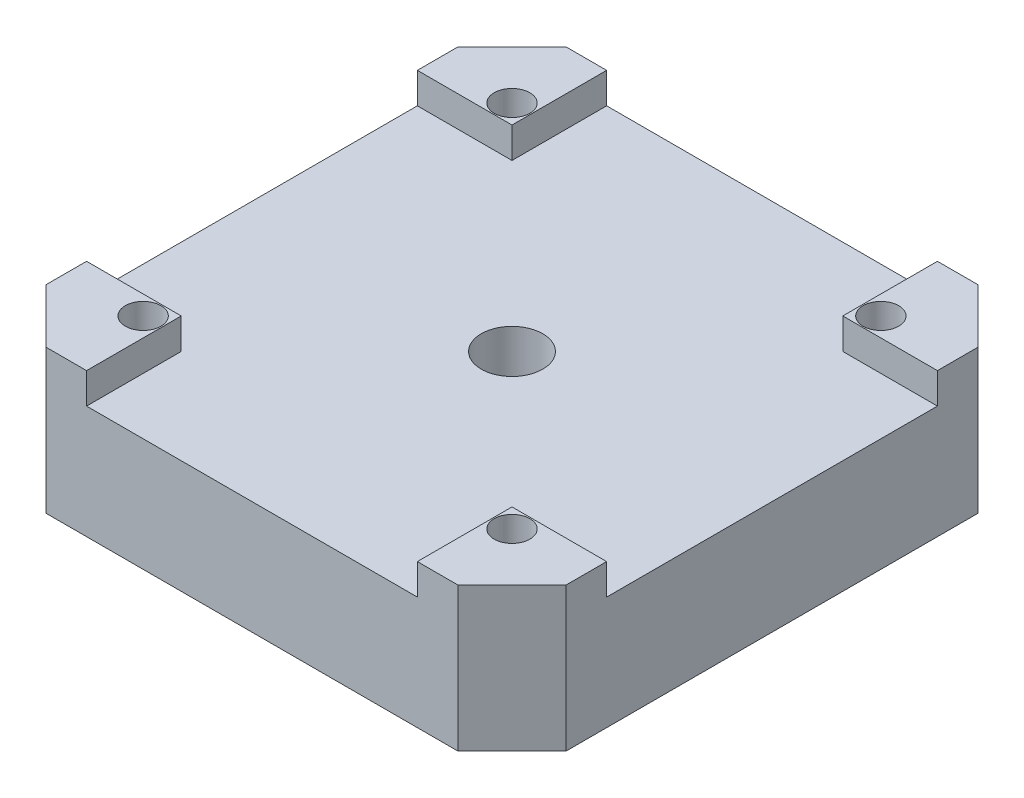
ISO-10303-21;
HEADER;
FILE_DESCRIPTION(('STEP AP214'),'2;1');
FILE_NAME('part.step','',(''),(''),'','','');
FILE_SCHEMA(('AUTOMOTIVE_DESIGN { 1 0 10303 214 1 1 1 1 }'));
ENDSEC;
DATA;
#1=APPLICATION_CONTEXT('core data for automotive mechanical design processes');
#2=APPLICATION_PROTOCOL_DEFINITION('international standard','automotive_design',2000,#1);
#3=PRODUCT_CONTEXT('',#1,'mechanical');
#4=PRODUCT('Part','Part','',(#3));
#5=PRODUCT_RELATED_PRODUCT_CATEGORY('part','',(#4));
#6=PRODUCT_DEFINITION_FORMATION('','',#4);
#7=PRODUCT_DEFINITION_CONTEXT('part definition',#1,'design');
#8=PRODUCT_DEFINITION('design','',#6,#7);
#9=PRODUCT_DEFINITION_SHAPE('','',#8);
#10=(LENGTH_UNIT() NAMED_UNIT(*) SI_UNIT(.MILLI.,.METRE.));
#11=(NAMED_UNIT(*) PLANE_ANGLE_UNIT() SI_UNIT($,.RADIAN.));
#12=(NAMED_UNIT(*) SI_UNIT($,.STERADIAN.) SOLID_ANGLE_UNIT());
#13=UNCERTAINTY_MEASURE_WITH_UNIT(LENGTH_MEASURE(1.E-05),#10,'distance_accuracy_value','');
#14=(GEOMETRIC_REPRESENTATION_CONTEXT(3) GLOBAL_UNCERTAINTY_ASSIGNED_CONTEXT((#13)) GLOBAL_UNIT_ASSIGNED_CONTEXT((#10,
#11,#12)) REPRESENTATION_CONTEXT('',''));
#15=CARTESIAN_POINT('',(0.,0.,0.));
#16=DIRECTION('',(0.,0.,1.));
#17=DIRECTION('',(1.,0.,0.));
#18=AXIS2_PLACEMENT_3D('',#15,#16,#17);
#19=CARTESIAN_POINT('',(0.,11.7,0.));
#20=DIRECTION('',(0.,-1.,0.));
#21=DIRECTION('',(0.,0.,-1.));
#22=AXIS2_PLACEMENT_3D('',#19,#20,#21);
#23=PLANE('',#22);
#24=CARTESIAN_POINT('',(15.,11.7,-15.));
#25=DIRECTION('',(0.,-1.,0.));
#26=DIRECTION('',(0.,0.,-1.));
#27=AXIS2_PLACEMENT_3D('',#24,#25,#26);
#28=CIRCLE('',#27,1.45);
#29=CARTESIAN_POINT('',(15.,11.7,-16.45));
#30=VERTEX_POINT('',#29);
#31=EDGE_CURVE('E362',#30,#30,#28,.T.);
#32=ORIENTED_EDGE('',*,*,#31,.T.);
#33=EDGE_LOOP('',(#32));
#34=FACE_BOUND('',#33,.T.);
#35=DIRECTION('',(-1.,0.,0.));
#36=VECTOR('',#35,1.);
#37=CARTESIAN_POINT('',(-16.750923471599,11.7,-21.15));
#38=LINE('',#37,#36);
#39=CARTESIAN_POINT('',(16.750923471599,11.7,-21.15));
#40=VERTEX_POINT('',#39);
#41=CARTESIAN_POINT('',(13.450923471599,11.7,-21.15));
#42=VERTEX_POINT('',#41);
#43=EDGE_CURVE('E191',#40,#42,#38,.T.);
#44=ORIENTED_EDGE('',*,*,#43,.T.);
#45=DIRECTION('',(0.,0.,1.));
#46=VECTOR('',#45,1.);
#47=CARTESIAN_POINT('',(13.450923471599,11.7,-21.15));
#48=LINE('',#47,#46);
#49=CARTESIAN_POINT('',(13.450923471599,11.7,-13.4509234715989));
#50=VERTEX_POINT('',#49);
#51=EDGE_CURVE('E299',#42,#50,#48,.T.);
#52=ORIENTED_EDGE('',*,*,#51,.T.);
#53=DIRECTION('',(1.,0.,0.));
#54=VECTOR('',#53,1.);
#55=CARTESIAN_POINT('',(-21.15,11.7,-13.4509234715989));
#56=LINE('',#55,#54);
#57=CARTESIAN_POINT('',(21.15,11.7,-13.4509234715989));
#58=VERTEX_POINT('',#57);
#59=EDGE_CURVE('E285',#50,#58,#56,.T.);
#60=ORIENTED_EDGE('',*,*,#59,.T.);
#61=DIRECTION('',(0.,0.,-1.));
#62=VECTOR('',#61,1.);
#63=CARTESIAN_POINT('',(21.15,11.7,16.7509234715989));
#64=LINE('',#63,#62);
#65=CARTESIAN_POINT('',(21.15,11.7,-16.7509234715989));
#66=VERTEX_POINT('',#65);
#67=EDGE_CURVE('E273',#58,#66,#64,.T.);
#68=ORIENTED_EDGE('',*,*,#67,.T.);
#69=DIRECTION('',(-0.707106781186542,0.,-0.707106781186553));
#70=VECTOR('',#69,1.);
#71=CARTESIAN_POINT('',(16.750923471599,11.7,-21.15));
#72=LINE('',#71,#70);
#73=EDGE_CURVE('E192',#66,#40,#72,.T.);
#74=ORIENTED_EDGE('',*,*,#73,.T.);
#75=EDGE_LOOP('',(#44,#52,#60,#68,#74));
#76=FACE_BOUND('',#75,.T.);
#77=ADVANCED_FACE('F32',(#34,#76),#23,.F.);
#78=CARTESIAN_POINT('',(15.,11.7,15.));
#79=DIRECTION('',(0.,-1.,0.));
#80=DIRECTION('',(0.,0.,-1.));
#81=AXIS2_PLACEMENT_3D('',#78,#79,#80);
#82=CIRCLE('',#81,1.45);
#83=CARTESIAN_POINT('',(15.,11.7,13.55));
#84=VERTEX_POINT('',#83);
#85=EDGE_CURVE('E374',#84,#84,#82,.T.);
#86=ORIENTED_EDGE('',*,*,#85,.T.);
#87=EDGE_LOOP('',(#86));
#88=FACE_BOUND('',#87,.T.);
#89=DIRECTION('',(1.,0.,0.));
#90=VECTOR('',#89,1.);
#91=CARTESIAN_POINT('',(-21.15,11.7,13.4509234715989));
#92=LINE('',#91,#90);
#93=CARTESIAN_POINT('',(13.450923471599,11.7,13.4509234715989));
#94=VERTEX_POINT('',#93);
#95=CARTESIAN_POINT('',(21.15,11.7,13.4509234715989));
#96=VERTEX_POINT('',#95);
#97=EDGE_CURVE('E263',#94,#96,#92,.T.);
#98=ORIENTED_EDGE('',*,*,#97,.F.);
#99=CARTESIAN_POINT('',(13.450923471599,11.7,21.15));
#100=VERTEX_POINT('',#99);
#101=EDGE_CURVE('E302',#94,#100,#48,.T.);
#102=ORIENTED_EDGE('',*,*,#101,.T.);
#103=DIRECTION('',(1.,0.,0.));
#104=VECTOR('',#103,1.);
#105=CARTESIAN_POINT('',(-16.750923471599,11.7,21.15));
#106=LINE('',#105,#104);
#107=CARTESIAN_POINT('',(16.750923471599,11.7,21.15));
#108=VERTEX_POINT('',#107);
#109=EDGE_CURVE('E268',#100,#108,#106,.T.);
#110=ORIENTED_EDGE('',*,*,#109,.T.);
#111=DIRECTION('',(0.707106781186546,0.,-0.707106781186549));
#112=VECTOR('',#111,1.);
#113=CARTESIAN_POINT('',(16.750923471599,11.7,21.15));
#114=LINE('',#113,#112);
#115=CARTESIAN_POINT('',(21.15,11.7,16.7509234715989));
#116=VERTEX_POINT('',#115);
#117=EDGE_CURVE('E272',#108,#116,#114,.T.);
#118=ORIENTED_EDGE('',*,*,#117,.T.);
#119=EDGE_CURVE('E196',#116,#96,#64,.T.);
#120=ORIENTED_EDGE('',*,*,#119,.T.);
#121=EDGE_LOOP('',(#98,#102,#110,#118,#120));
#122=FACE_BOUND('',#121,.T.);
#123=ADVANCED_FACE('F435',(#88,#122),#23,.F.);
#124=CARTESIAN_POINT('',(-21.15,9.2,-13.4509234715989));
#125=DIRECTION('',(0.,0.,-1.));
#126=DIRECTION('',(-1.,0.,0.));
#127=AXIS2_PLACEMENT_3D('',#124,#125,#126);
#128=PLANE('',#127);
#129=ORIENTED_EDGE('',*,*,#59,.F.);
#130=DIRECTION('',(0.,-1.,0.));
#131=VECTOR('',#130,1.);
#132=CARTESIAN_POINT('',(13.450923471599,9.20000000000002,-13.4509234715989));
#133=LINE('',#132,#131);
#134=CARTESIAN_POINT('',(13.450923471599,9.2,-13.4509234715989));
#135=VERTEX_POINT('',#134);
#136=EDGE_CURVE('E307',#50,#135,#133,.T.);
#137=ORIENTED_EDGE('',*,*,#136,.T.);
#138=DIRECTION('',(1.,0.,0.));
#139=VECTOR('',#138,1.);
#140=CARTESIAN_POINT('',(-21.15,9.2,-13.4509234715989));
#141=LINE('',#140,#139);
#142=CARTESIAN_POINT('',(21.15,9.2,-13.4509234715989));
#143=VERTEX_POINT('',#142);
#144=EDGE_CURVE('E255',#135,#143,#141,.T.);
#145=ORIENTED_EDGE('',*,*,#144,.T.);
#146=DIRECTION('',(0.,1.,0.));
#147=VECTOR('',#146,1.);
#148=CARTESIAN_POINT('',(21.15,9.2,-13.4509234715989));
#149=LINE('',#148,#147);
#150=EDGE_CURVE('E309',#143,#58,#149,.T.);
#151=ORIENTED_EDGE('',*,*,#150,.T.);
#152=EDGE_LOOP('',(#129,#137,#145,#151));
#153=FACE_BOUND('',#152,.T.);
#154=ADVANCED_FACE('F306',(#153),#128,.F.);
#155=CARTESIAN_POINT('',(-21.15,11.7,13.4509234715989));
#156=DIRECTION('',(0.,0.,1.));
#157=DIRECTION('',(1.,0.,0.));
#158=AXIS2_PLACEMENT_3D('',#155,#156,#157);
#159=PLANE('',#158);
#160=DIRECTION('',(1.,0.,0.));
#161=VECTOR('',#160,1.);
#162=CARTESIAN_POINT('',(-21.15,9.2,13.4509234715989));
#163=LINE('',#162,#161);
#164=CARTESIAN_POINT('',(13.450923471599,9.2,13.4509234715989));
#165=VERTEX_POINT('',#164);
#166=CARTESIAN_POINT('',(21.15,9.2,13.4509234715989));
#167=VERTEX_POINT('',#166);
#168=EDGE_CURVE('E256',#165,#167,#163,.T.);
#169=ORIENTED_EDGE('',*,*,#168,.F.);
#170=DIRECTION('',(0.,1.,0.));
#171=VECTOR('',#170,1.);
#172=CARTESIAN_POINT('',(13.450923471599,11.7,13.4509234715989));
#173=LINE('',#172,#171);
#174=EDGE_CURVE('E11',#165,#94,#173,.T.);
#175=ORIENTED_EDGE('',*,*,#174,.T.);
#176=ORIENTED_EDGE('',*,*,#97,.T.);
#177=DIRECTION('',(0.,-1.,0.));
#178=VECTOR('',#177,1.);
#179=CARTESIAN_POINT('',(21.15,11.7,13.4509234715989));
#180=LINE('',#179,#178);
#181=EDGE_CURVE('E317',#96,#167,#180,.T.);
#182=ORIENTED_EDGE('',*,*,#181,.T.);
#183=EDGE_LOOP('',(#169,#175,#176,#182));
#184=FACE_BOUND('',#183,.T.);
#185=ADVANCED_FACE('F445',(#184),#159,.F.);
#186=CARTESIAN_POINT('',(-15.,11.7,-15.));
#187=DIRECTION('',(0.,-1.,0.));
#188=DIRECTION('',(0.,0.,-1.));
#189=AXIS2_PLACEMENT_3D('',#186,#187,#188);
#190=CIRCLE('',#189,1.45);
#191=CARTESIAN_POINT('',(-15.,11.7,-16.45));
#192=VERTEX_POINT('',#191);
#193=EDGE_CURVE('E350',#192,#192,#190,.T.);
#194=ORIENTED_EDGE('',*,*,#193,.T.);
#195=EDGE_LOOP('',(#194));
#196=FACE_BOUND('',#195,.T.);
#197=CARTESIAN_POINT('',(-21.15,11.7,-13.4509234715989));
#198=VERTEX_POINT('',#197);
#199=CARTESIAN_POINT('',(-13.450923471599,11.7,-13.4509234715989));
#200=VERTEX_POINT('',#199);
#201=EDGE_CURVE('E184',#198,#200,#56,.T.);
#202=ORIENTED_EDGE('',*,*,#201,.T.);
#203=DIRECTION('',(0.,0.,1.));
#204=VECTOR('',#203,1.);
#205=CARTESIAN_POINT('',(-13.450923471599,11.7,-21.15));
#206=LINE('',#205,#204);
#207=CARTESIAN_POINT('',(-13.450923471599,11.7,-21.15));
#208=VERTEX_POINT('',#207);
#209=EDGE_CURVE('E47',#208,#200,#206,.T.);
#210=ORIENTED_EDGE('',*,*,#209,.F.);
#211=CARTESIAN_POINT('',(-16.750923471599,11.7,-21.15));
#212=VERTEX_POINT('',#211);
#213=EDGE_CURVE('E181',#208,#212,#38,.T.);
#214=ORIENTED_EDGE('',*,*,#213,.T.);
#215=DIRECTION('',(-0.707106781186546,0.,0.707106781186549));
#216=VECTOR('',#215,1.);
#217=CARTESIAN_POINT('',(-21.15,11.7,-16.7509234715989));
#218=LINE('',#217,#216);
#219=CARTESIAN_POINT('',(-21.15,11.7,-16.7509234715989));
#220=VERTEX_POINT('',#219);
#221=EDGE_CURVE('E195',#212,#220,#218,.T.);
#222=ORIENTED_EDGE('',*,*,#221,.T.);
#223=DIRECTION('',(0.,0.,1.));
#224=VECTOR('',#223,1.);
#225=CARTESIAN_POINT('',(-21.15,11.7,16.7509234715989));
#226=LINE('',#225,#224);
#227=EDGE_CURVE('E264',#220,#198,#226,.T.);
#228=ORIENTED_EDGE('',*,*,#227,.T.);
#229=EDGE_LOOP('',(#202,#210,#214,#222,#228));
#230=FACE_BOUND('',#229,.T.);
#231=ADVANCED_FACE('F180',(#196,#230),#23,.F.);
#232=CARTESIAN_POINT('',(-21.15,11.7,16.7509234715989));
#233=DIRECTION('',(1.,0.,0.));
#234=DIRECTION('',(0.,0.,-1.));
#235=AXIS2_PLACEMENT_3D('',#232,#233,#234);
#236=PLANE('',#235);
#237=DIRECTION('',(0.,0.,-1.));
#238=VECTOR('',#237,1.);
#239=CARTESIAN_POINT('',(-21.15,9.2,13.4509234715989));
#240=LINE('',#239,#238);
#241=CARTESIAN_POINT('',(-21.15,9.2,13.4509234715989));
#242=VERTEX_POINT('',#241);
#243=CARTESIAN_POINT('',(-21.15,9.2,-13.4509234715989));
#244=VERTEX_POINT('',#243);
#245=EDGE_CURVE('E253',#242,#244,#240,.T.);
#246=ORIENTED_EDGE('',*,*,#245,.T.);
#247=DIRECTION('',(0.,1.,0.));
#248=VECTOR('',#247,1.);
#249=CARTESIAN_POINT('',(-21.15,9.2,-13.4509234715989));
#250=LINE('',#249,#248);
#251=EDGE_CURVE('E320',#244,#198,#250,.T.);
#252=ORIENTED_EDGE('',*,*,#251,.T.);
#253=ORIENTED_EDGE('',*,*,#227,.F.);
#254=DIRECTION('',(0.,-1.,0.));
#255=VECTOR('',#254,1.);
#256=CARTESIAN_POINT('',(-21.15,11.7,-16.7509234715989));
#257=LINE('',#256,#255);
#258=CARTESIAN_POINT('',(-21.15,0.,-16.7509234715989));
#259=VERTEX_POINT('',#258);
#260=EDGE_CURVE('E201',#220,#259,#257,.T.);
#261=ORIENTED_EDGE('',*,*,#260,.T.);
#262=DIRECTION('',(0.,0.,1.));
#263=VECTOR('',#262,1.);
#264=CARTESIAN_POINT('',(-21.15,0.,16.7509234715989));
#265=LINE('',#264,#263);
#266=CARTESIAN_POINT('',(-21.15,0.,16.7509234715989));
#267=VERTEX_POINT('',#266);
#268=EDGE_CURVE('E202',#259,#267,#265,.T.);
#269=ORIENTED_EDGE('',*,*,#268,.T.);
#270=DIRECTION('',(0.,-1.,0.));
#271=VECTOR('',#270,1.);
#272=CARTESIAN_POINT('',(-21.15,11.7,16.7509234715989));
#273=LINE('',#272,#271);
#274=CARTESIAN_POINT('',(-21.15,11.7,16.7509234715989));
#275=VERTEX_POINT('',#274);
#276=EDGE_CURVE('E238',#275,#267,#273,.T.);
#277=ORIENTED_EDGE('',*,*,#276,.F.);
#278=CARTESIAN_POINT('',(-21.15,11.7,13.4509234715989));
#279=VERTEX_POINT('',#278);
#280=EDGE_CURVE('E219',#279,#275,#226,.T.);
#281=ORIENTED_EDGE('',*,*,#280,.F.);
#282=DIRECTION('',(0.,-1.,0.));
#283=VECTOR('',#282,1.);
#284=CARTESIAN_POINT('',(-21.15,11.7,13.4509234715989));
#285=LINE('',#284,#283);
#286=EDGE_CURVE('E313',#279,#242,#285,.T.);
#287=ORIENTED_EDGE('',*,*,#286,.T.);
#288=EDGE_LOOP('',(#246,#252,#253,#261,#269,#277,#281,#287));
#289=FACE_BOUND('',#288,.T.);
#290=ADVANCED_FACE('F34',(#289),#236,.F.);
#291=CARTESIAN_POINT('',(-21.15,11.7,16.7509234715989));
#292=DIRECTION('',(0.707106781186553,0.,-0.707106781186542));
#293=DIRECTION('',(-0.707106781186542,0.,-0.707106781186553));
#294=AXIS2_PLACEMENT_3D('',#291,#292,#293);
#295=PLANE('',#294);
#296=DIRECTION('',(0.707106781186542,0.,0.707106781186553));
#297=VECTOR('',#296,1.);
#298=CARTESIAN_POINT('',(-21.15,0.,16.7509234715989));
#299=LINE('',#298,#297);
#300=CARTESIAN_POINT('',(-16.750923471599,0.,21.15));
#301=VERTEX_POINT('',#300);
#302=EDGE_CURVE('E205',#267,#301,#299,.T.);
#303=ORIENTED_EDGE('',*,*,#302,.T.);
#304=DIRECTION('',(0.,-1.,0.));
#305=VECTOR('',#304,1.);
#306=CARTESIAN_POINT('',(-16.750923471599,11.7,21.15));
#307=LINE('',#306,#305);
#308=CARTESIAN_POINT('',(-16.750923471599,11.7,21.15));
#309=VERTEX_POINT('',#308);
#310=EDGE_CURVE('E235',#309,#301,#307,.T.);
#311=ORIENTED_EDGE('',*,*,#310,.F.);
#312=DIRECTION('',(0.707106781186542,0.,0.707106781186553));
#313=VECTOR('',#312,1.);
#314=CARTESIAN_POINT('',(-21.15,11.7,16.7509234715989));
#315=LINE('',#314,#313);
#316=EDGE_CURVE('E266',#275,#309,#315,.T.);
#317=ORIENTED_EDGE('',*,*,#316,.F.);
#318=ORIENTED_EDGE('',*,*,#276,.T.);
#319=EDGE_LOOP('',(#303,#311,#317,#318));
#320=FACE_BOUND('',#319,.T.);
#321=ADVANCED_FACE('F718',(#320),#295,.F.);
#322=CARTESIAN_POINT('',(-16.750923471599,11.7,21.15));
#323=DIRECTION('',(0.,0.,-1.));
#324=DIRECTION('',(-1.,0.,0.));
#325=AXIS2_PLACEMENT_3D('',#322,#323,#324);
#326=PLANE('',#325);
#327=ORIENTED_EDGE('',*,*,#109,.F.);
#328=DIRECTION('',(0.,1.,0.));
#329=VECTOR('',#328,1.);
#330=CARTESIAN_POINT('',(13.450923471599,9.2,21.15));
#331=LINE('',#330,#329);
#332=CARTESIAN_POINT('',(13.450923471599,9.2,21.15));
#333=VERTEX_POINT('',#332);
#334=EDGE_CURVE('E176',#333,#100,#331,.T.);
#335=ORIENTED_EDGE('',*,*,#334,.F.);
#336=DIRECTION('',(1.,0.,0.));
#337=VECTOR('',#336,1.);
#338=CARTESIAN_POINT('',(-13.450923471599,9.2,21.15));
#339=LINE('',#338,#337);
#340=CARTESIAN_POINT('',(-13.450923471599,9.2,21.15));
#341=VERTEX_POINT('',#340);
#342=EDGE_CURVE('E332',#341,#333,#339,.T.);
#343=ORIENTED_EDGE('',*,*,#342,.F.);
#344=DIRECTION('',(0.,-1.,0.));
#345=VECTOR('',#344,1.);
#346=CARTESIAN_POINT('',(-13.450923471599,11.7,21.15));
#347=LINE('',#346,#345);
#348=CARTESIAN_POINT('',(-13.450923471599,11.7,21.15));
#349=VERTEX_POINT('',#348);
#350=EDGE_CURVE('E334',#349,#341,#347,.T.);
#351=ORIENTED_EDGE('',*,*,#350,.F.);
#352=EDGE_CURVE('E269',#309,#349,#106,.T.);
#353=ORIENTED_EDGE('',*,*,#352,.F.);
#354=ORIENTED_EDGE('',*,*,#310,.T.);
#355=DIRECTION('',(1.,0.,0.));
#356=VECTOR('',#355,1.);
#357=CARTESIAN_POINT('',(-16.750923471599,0.,21.15));
#358=LINE('',#357,#356);
#359=CARTESIAN_POINT('',(16.750923471599,0.,21.15));
#360=VERTEX_POINT('',#359);
#361=EDGE_CURVE('E207',#301,#360,#358,.T.);
#362=ORIENTED_EDGE('',*,*,#361,.T.);
#363=DIRECTION('',(0.,-1.,0.));
#364=VECTOR('',#363,1.);
#365=CARTESIAN_POINT('',(16.750923471599,11.7,21.15));
#366=LINE('',#365,#364);
#367=EDGE_CURVE('E232',#108,#360,#366,.T.);
#368=ORIENTED_EDGE('',*,*,#367,.F.);
#369=EDGE_LOOP('',(#327,#335,#343,#351,#353,#354,#362,#368));
#370=FACE_BOUND('',#369,.T.);
#371=ADVANCED_FACE('F737',(#370),#326,.F.);
#372=CARTESIAN_POINT('',(16.750923471599,11.7,21.15));
#373=DIRECTION('',(-0.707106781186549,0.,-0.707106781186546));
#374=DIRECTION('',(-0.707106781186546,0.,0.707106781186549));
#375=AXIS2_PLACEMENT_3D('',#372,#373,#374);
#376=PLANE('',#375);
#377=DIRECTION('',(0.707106781186546,0.,-0.707106781186549));
#378=VECTOR('',#377,1.);
#379=CARTESIAN_POINT('',(16.750923471599,0.,21.15));
#380=LINE('',#379,#378);
#381=CARTESIAN_POINT('',(21.15,0.,16.7509234715989));
#382=VERTEX_POINT('',#381);
#383=EDGE_CURVE('E209',#360,#382,#380,.T.);
#384=ORIENTED_EDGE('',*,*,#383,.T.);
#385=DIRECTION('',(0.,-1.,0.));
#386=VECTOR('',#385,1.);
#387=CARTESIAN_POINT('',(21.15,11.7,16.7509234715989));
#388=LINE('',#387,#386);
#389=EDGE_CURVE('E229',#116,#382,#388,.T.);
#390=ORIENTED_EDGE('',*,*,#389,.F.);
#391=ORIENTED_EDGE('',*,*,#117,.F.);
#392=ORIENTED_EDGE('',*,*,#367,.T.);
#393=EDGE_LOOP('',(#384,#390,#391,#392));
#394=FACE_BOUND('',#393,.T.);
#395=ADVANCED_FACE('F707',(#394),#376,.F.);
#396=CARTESIAN_POINT('',(21.15,11.7,16.7509234715989));
#397=DIRECTION('',(-1.,0.,0.));
#398=DIRECTION('',(0.,0.,1.));
#399=AXIS2_PLACEMENT_3D('',#396,#397,#398);
#400=PLANE('',#399);
#401=ORIENTED_EDGE('',*,*,#67,.F.);
#402=ORIENTED_EDGE('',*,*,#150,.F.);
#403=DIRECTION('',(0.,0.,-1.));
#404=VECTOR('',#403,1.);
#405=CARTESIAN_POINT('',(21.15,9.2,13.4509234715989));
#406=LINE('',#405,#404);
#407=EDGE_CURVE('E314',#167,#143,#406,.T.);
#408=ORIENTED_EDGE('',*,*,#407,.F.);
#409=ORIENTED_EDGE('',*,*,#181,.F.);
#410=ORIENTED_EDGE('',*,*,#119,.F.);
#411=ORIENTED_EDGE('',*,*,#389,.T.);
#412=DIRECTION('',(0.,0.,-1.));
#413=VECTOR('',#412,1.);
#414=CARTESIAN_POINT('',(21.15,0.,16.7509234715989));
#415=LINE('',#414,#413);
#416=CARTESIAN_POINT('',(21.15,0.,-16.7509234715989));
#417=VERTEX_POINT('',#416);
#418=EDGE_CURVE('E211',#382,#417,#415,.T.);
#419=ORIENTED_EDGE('',*,*,#418,.T.);
#420=DIRECTION('',(0.,-1.,0.));
#421=VECTOR('',#420,1.);
#422=CARTESIAN_POINT('',(21.15,11.7,-16.7509234715989));
#423=LINE('',#422,#421);
#424=EDGE_CURVE('E226',#66,#417,#423,.T.);
#425=ORIENTED_EDGE('',*,*,#424,.F.);
#426=EDGE_LOOP('',(#401,#402,#408,#409,#410,#411,#419,#425));
#427=FACE_BOUND('',#426,.T.);
#428=ADVANCED_FACE('F289',(#427),#400,.F.);
#429=CARTESIAN_POINT('',(16.750923471599,11.7,-21.15));
#430=DIRECTION('',(-0.707106781186553,0.,0.707106781186542));
#431=DIRECTION('',(0.707106781186542,0.,0.707106781186553));
#432=AXIS2_PLACEMENT_3D('',#429,#430,#431);
#433=PLANE('',#432);
#434=DIRECTION('',(-0.707106781186542,0.,-0.707106781186553));
#435=VECTOR('',#434,1.);
#436=CARTESIAN_POINT('',(16.750923471599,0.,-21.15));
#437=LINE('',#436,#435);
#438=CARTESIAN_POINT('',(16.750923471599,0.,-21.15));
#439=VERTEX_POINT('',#438);
#440=EDGE_CURVE('E213',#417,#439,#437,.T.);
#441=ORIENTED_EDGE('',*,*,#440,.T.);
#442=DIRECTION('',(0.,-1.,0.));
#443=VECTOR('',#442,1.);
#444=CARTESIAN_POINT('',(16.750923471599,11.7,-21.15));
#445=LINE('',#444,#443);
#446=EDGE_CURVE('E223',#40,#439,#445,.T.);
#447=ORIENTED_EDGE('',*,*,#446,.F.);
#448=ORIENTED_EDGE('',*,*,#73,.F.);
#449=ORIENTED_EDGE('',*,*,#424,.T.);
#450=EDGE_LOOP('',(#441,#447,#448,#449));
#451=FACE_BOUND('',#450,.T.);
#452=ADVANCED_FACE('F293',(#451),#433,.F.);
#453=CARTESIAN_POINT('',(-16.750923471599,11.7,-21.15));
#454=DIRECTION('',(0.,0.,1.));
#455=DIRECTION('',(1.,0.,0.));
#456=AXIS2_PLACEMENT_3D('',#453,#454,#455);
#457=PLANE('',#456);
#458=DIRECTION('',(1.,0.,0.));
#459=VECTOR('',#458,1.);
#460=CARTESIAN_POINT('',(-13.450923471599,9.2,-21.15));
#461=LINE('',#460,#459);
#462=CARTESIAN_POINT('',(-13.450923471599,9.2,-21.15));
#463=VERTEX_POINT('',#462);
#464=CARTESIAN_POINT('',(13.450923471599,9.2,-21.15));
#465=VERTEX_POINT('',#464);
#466=EDGE_CURVE('E175',#463,#465,#461,.T.);
#467=ORIENTED_EDGE('',*,*,#466,.T.);
#468=DIRECTION('',(0.,1.,0.));
#469=VECTOR('',#468,1.);
#470=CARTESIAN_POINT('',(13.450923471599,9.2,-21.15));
#471=LINE('',#470,#469);
#472=EDGE_CURVE('E298',#465,#42,#471,.T.);
#473=ORIENTED_EDGE('',*,*,#472,.T.);
#474=ORIENTED_EDGE('',*,*,#43,.F.);
#475=ORIENTED_EDGE('',*,*,#446,.T.);
#476=DIRECTION('',(-1.,0.,0.));
#477=VECTOR('',#476,1.);
#478=CARTESIAN_POINT('',(-16.750923471599,0.,-21.15));
#479=LINE('',#478,#477);
#480=CARTESIAN_POINT('',(-16.750923471599,0.,-21.15));
#481=VERTEX_POINT('',#480);
#482=EDGE_CURVE('E215',#439,#481,#479,.T.);
#483=ORIENTED_EDGE('',*,*,#482,.T.);
#484=DIRECTION('',(0.,-1.,0.));
#485=VECTOR('',#484,1.);
#486=CARTESIAN_POINT('',(-16.750923471599,11.7,-21.15));
#487=LINE('',#486,#485);
#488=EDGE_CURVE('E189',#212,#481,#487,.T.);
#489=ORIENTED_EDGE('',*,*,#488,.F.);
#490=ORIENTED_EDGE('',*,*,#213,.F.);
#491=DIRECTION('',(0.,-1.,0.));
#492=VECTOR('',#491,1.);
#493=CARTESIAN_POINT('',(-13.450923471599,11.7,-21.15));
#494=LINE('',#493,#492);
#495=EDGE_CURVE('E167',#208,#463,#494,.T.);
#496=ORIENTED_EDGE('',*,*,#495,.T.);
#497=EDGE_LOOP('',(#467,#473,#474,#475,#483,#489,#490,#496));
#498=FACE_BOUND('',#497,.T.);
#499=ADVANCED_FACE('F187',(#498),#457,.F.);
#500=CARTESIAN_POINT('',(-21.15,11.7,-16.7509234715989));
#501=DIRECTION('',(0.707106781186549,0.,0.707106781186546));
#502=DIRECTION('',(0.707106781186546,0.,-0.707106781186549));
#503=AXIS2_PLACEMENT_3D('',#500,#501,#502);
#504=PLANE('',#503);
#505=DIRECTION('',(-0.707106781186546,0.,0.707106781186549));
#506=VECTOR('',#505,1.);
#507=CARTESIAN_POINT('',(-21.15,0.,-16.7509234715989));
#508=LINE('',#507,#506);
#509=EDGE_CURVE('E217',#481,#259,#508,.T.);
#510=ORIENTED_EDGE('',*,*,#509,.T.);
#511=ORIENTED_EDGE('',*,*,#260,.F.);
#512=ORIENTED_EDGE('',*,*,#221,.F.);
#513=ORIENTED_EDGE('',*,*,#488,.T.);
#514=EDGE_LOOP('',(#510,#511,#512,#513));
#515=FACE_BOUND('',#514,.T.);
#516=ADVANCED_FACE('F424',(#515),#504,.F.);
#517=CARTESIAN_POINT('',(-15.,11.7,15.));
#518=DIRECTION('',(0.,-1.,0.));
#519=DIRECTION('',(0.,0.,-1.));
#520=AXIS2_PLACEMENT_3D('',#517,#518,#519);
#521=CIRCLE('',#520,1.45);
#522=CARTESIAN_POINT('',(-15.,11.7,13.55));
#523=VERTEX_POINT('',#522);
#524=EDGE_CURVE('E386',#523,#523,#521,.T.);
#525=ORIENTED_EDGE('',*,*,#524,.T.);
#526=EDGE_LOOP('',(#525));
#527=FACE_BOUND('',#526,.T.);
#528=ORIENTED_EDGE('',*,*,#352,.T.);
#529=CARTESIAN_POINT('',(-13.450923471599,11.7,13.4509234715989));
#530=VERTEX_POINT('',#529);
#531=EDGE_CURVE('E185',#530,#349,#206,.T.);
#532=ORIENTED_EDGE('',*,*,#531,.F.);
#533=EDGE_CURVE('E247',#279,#530,#92,.T.);
#534=ORIENTED_EDGE('',*,*,#533,.F.);
#535=ORIENTED_EDGE('',*,*,#280,.T.);
#536=ORIENTED_EDGE('',*,*,#316,.T.);
#537=EDGE_LOOP('',(#528,#532,#534,#535,#536));
#538=FACE_BOUND('',#537,.T.);
#539=ADVANCED_FACE('F405',(#527,#538),#23,.F.);
#540=CARTESIAN_POINT('',(0.,0.,0.));
#541=DIRECTION('',(0.,-1.,0.));
#542=DIRECTION('',(0.,0.,-1.));
#543=AXIS2_PLACEMENT_3D('',#540,#541,#542);
#544=PLANE('',#543);
#545=CARTESIAN_POINT('',(-15.,0.,15.));
#546=DIRECTION('',(0.,-1.,0.));
#547=DIRECTION('',(0.,0.,-1.));
#548=AXIS2_PLACEMENT_3D('',#545,#546,#547);
#549=CIRCLE('',#548,3.);
#550=CARTESIAN_POINT('',(-15.,0.,12.));
#551=VERTEX_POINT('',#550);
#552=EDGE_CURVE('E395',#551,#551,#549,.T.);
#553=ORIENTED_EDGE('',*,*,#552,.F.);
#554=EDGE_LOOP('',(#553));
#555=FACE_BOUND('',#554,.T.);
#556=CARTESIAN_POINT('',(15.,0.,15.));
#557=DIRECTION('',(0.,-1.,0.));
#558=DIRECTION('',(0.,0.,-1.));
#559=AXIS2_PLACEMENT_3D('',#556,#557,#558);
#560=CIRCLE('',#559,3.);
#561=CARTESIAN_POINT('',(15.,0.,12.));
#562=VERTEX_POINT('',#561);
#563=EDGE_CURVE('E383',#562,#562,#560,.T.);
#564=ORIENTED_EDGE('',*,*,#563,.F.);
#565=EDGE_LOOP('',(#564));
#566=FACE_BOUND('',#565,.T.);
#567=CARTESIAN_POINT('',(15.,0.,-15.));
#568=DIRECTION('',(0.,-1.,0.));
#569=DIRECTION('',(0.,0.,-1.));
#570=AXIS2_PLACEMENT_3D('',#567,#568,#569);
#571=CIRCLE('',#570,3.);
#572=CARTESIAN_POINT('',(15.,0.,-18.));
#573=VERTEX_POINT('',#572);
#574=EDGE_CURVE('E371',#573,#573,#571,.T.);
#575=ORIENTED_EDGE('',*,*,#574,.F.);
#576=EDGE_LOOP('',(#575));
#577=FACE_BOUND('',#576,.T.);
#578=CARTESIAN_POINT('',(-15.,0.,-15.));
#579=DIRECTION('',(0.,-1.,0.));
#580=DIRECTION('',(0.,0.,-1.));
#581=AXIS2_PLACEMENT_3D('',#578,#579,#580);
#582=CIRCLE('',#581,3.);
#583=CARTESIAN_POINT('',(-15.,0.,-18.));
#584=VERTEX_POINT('',#583);
#585=EDGE_CURVE('E359',#584,#584,#582,.T.);
#586=ORIENTED_EDGE('',*,*,#585,.F.);
#587=EDGE_LOOP('',(#586));
#588=FACE_BOUND('',#587,.T.);
#589=CARTESIAN_POINT('',(0.,0.,0.));
#590=DIRECTION('',(0.,-1.,0.));
#591=DIRECTION('',(0.,0.,-1.));
#592=AXIS2_PLACEMENT_3D('',#589,#590,#591);
#593=CIRCLE('',#592,3.25);
#594=CARTESIAN_POINT('',(0.,0.,-3.25));
#595=VERTEX_POINT('',#594);
#596=EDGE_CURVE('E339',#595,#595,#593,.T.);
#597=ORIENTED_EDGE('',*,*,#596,.F.);
#598=EDGE_LOOP('',(#597));
#599=FACE_BOUND('',#598,.T.);
#600=ORIENTED_EDGE('',*,*,#268,.F.);
#601=ORIENTED_EDGE('',*,*,#509,.F.);
#602=ORIENTED_EDGE('',*,*,#482,.F.);
#603=ORIENTED_EDGE('',*,*,#440,.F.);
#604=ORIENTED_EDGE('',*,*,#418,.F.);
#605=ORIENTED_EDGE('',*,*,#383,.F.);
#606=ORIENTED_EDGE('',*,*,#361,.F.);
#607=ORIENTED_EDGE('',*,*,#302,.F.);
#608=EDGE_LOOP('',(#600,#601,#602,#603,#604,#605,#606,#607));
#609=FACE_BOUND('',#608,.T.);
#610=ADVANCED_FACE('F401',(#555,#566,#577,#588,#599,#609),#544,.T.);
#611=CARTESIAN_POINT('',(-13.450923471599,9.2,-13.4509234715989));
#612=VERTEX_POINT('',#611);
#613=EDGE_CURVE('E258',#244,#612,#141,.T.);
#614=ORIENTED_EDGE('',*,*,#613,.T.);
#615=DIRECTION('',(0.,1.,0.));
#616=VECTOR('',#615,1.);
#617=CARTESIAN_POINT('',(-13.450923471599,9.2,-13.4509234715989));
#618=LINE('',#617,#616);
#619=EDGE_CURVE('E301',#612,#200,#618,.T.);
#620=ORIENTED_EDGE('',*,*,#619,.T.);
#621=ORIENTED_EDGE('',*,*,#201,.F.);
#622=ORIENTED_EDGE('',*,*,#251,.F.);
#623=EDGE_LOOP('',(#614,#620,#621,#622));
#624=FACE_BOUND('',#623,.T.);
#625=ADVANCED_FACE('F404',(#624),#128,.F.);
#626=CARTESIAN_POINT('',(-21.15,9.2,13.4509234715989));
#627=DIRECTION('',(0.,-1.,0.));
#628=DIRECTION('',(0.,0.,-1.));
#629=AXIS2_PLACEMENT_3D('',#626,#627,#628);
#630=PLANE('',#629);
#631=CARTESIAN_POINT('',(0.,9.2,0.));
#632=DIRECTION('',(0.,-1.,0.));
#633=DIRECTION('',(0.,0.,-1.));
#634=AXIS2_PLACEMENT_3D('',#631,#632,#633);
#635=CIRCLE('',#634,2.5);
#636=CARTESIAN_POINT('',(0.,9.2,-2.5));
#637=VERTEX_POINT('',#636);
#638=EDGE_CURVE('E342',#637,#637,#635,.T.);
#639=ORIENTED_EDGE('',*,*,#638,.T.);
#640=EDGE_LOOP('',(#639));
#641=FACE_BOUND('',#640,.T.);
#642=CARTESIAN_POINT('',(-13.450923471599,9.2,13.4509234715989));
#643=VERTEX_POINT('',#642);
#644=EDGE_CURVE('E244',#242,#643,#163,.T.);
#645=ORIENTED_EDGE('',*,*,#644,.T.);
#646=DIRECTION('',(0.,0.,1.));
#647=VECTOR('',#646,1.);
#648=CARTESIAN_POINT('',(-13.450923471599,9.2,-21.15));
#649=LINE('',#648,#647);
#650=EDGE_CURVE('E55',#643,#341,#649,.T.);
#651=ORIENTED_EDGE('',*,*,#650,.T.);
#652=ORIENTED_EDGE('',*,*,#342,.T.);
#653=DIRECTION('',(0.,0.,1.));
#654=VECTOR('',#653,1.);
#655=CARTESIAN_POINT('',(13.450923471599,9.2,-21.15));
#656=LINE('',#655,#654);
#657=EDGE_CURVE('E328',#165,#333,#656,.T.);
#658=ORIENTED_EDGE('',*,*,#657,.F.);
#659=ORIENTED_EDGE('',*,*,#168,.T.);
#660=ORIENTED_EDGE('',*,*,#407,.T.);
#661=ORIENTED_EDGE('',*,*,#144,.F.);
#662=EDGE_CURVE('E329',#465,#135,#656,.T.);
#663=ORIENTED_EDGE('',*,*,#662,.F.);
#664=ORIENTED_EDGE('',*,*,#466,.F.);
#665=EDGE_CURVE('E170',#463,#612,#649,.T.);
#666=ORIENTED_EDGE('',*,*,#665,.T.);
#667=ORIENTED_EDGE('',*,*,#613,.F.);
#668=ORIENTED_EDGE('',*,*,#245,.F.);
#669=EDGE_LOOP('',(#645,#651,#652,#658,#659,#660,#661,#663,#664,#666,#667,#668));
#670=FACE_BOUND('',#669,.T.);
#671=ADVANCED_FACE('F250',(#641,#670),#630,.F.);
#672=ORIENTED_EDGE('',*,*,#533,.T.);
#673=DIRECTION('',(0.,-1.,0.));
#674=VECTOR('',#673,1.);
#675=CARTESIAN_POINT('',(-13.450923471599,11.7,13.4509234715989));
#676=LINE('',#675,#674);
#677=EDGE_CURVE('E40',#530,#643,#676,.T.);
#678=ORIENTED_EDGE('',*,*,#677,.T.);
#679=ORIENTED_EDGE('',*,*,#644,.F.);
#680=ORIENTED_EDGE('',*,*,#286,.F.);
#681=EDGE_LOOP('',(#672,#678,#679,#680));
#682=FACE_BOUND('',#681,.T.);
#683=ADVANCED_FACE('F243',(#682),#159,.F.);
#684=CARTESIAN_POINT('',(-13.450923471599,11.7,-21.15));
#685=DIRECTION('',(-1.,0.,0.));
#686=DIRECTION('',(0.,0.,1.));
#687=AXIS2_PLACEMENT_3D('',#684,#685,#686);
#688=PLANE('',#687);
#689=ORIENTED_EDGE('',*,*,#531,.T.);
#690=ORIENTED_EDGE('',*,*,#350,.T.);
#691=ORIENTED_EDGE('',*,*,#650,.F.);
#692=ORIENTED_EDGE('',*,*,#677,.F.);
#693=EDGE_LOOP('',(#689,#690,#691,#692));
#694=FACE_BOUND('',#693,.T.);
#695=ADVANCED_FACE('F444',(#694),#688,.F.);
#696=CARTESIAN_POINT('',(13.450923471599,9.2,-21.15));
#697=DIRECTION('',(1.,0.,0.));
#698=DIRECTION('',(0.,1.,0.));
#699=AXIS2_PLACEMENT_3D('',#696,#697,#698);
#700=PLANE('',#699);
#701=ORIENTED_EDGE('',*,*,#657,.T.);
#702=ORIENTED_EDGE('',*,*,#334,.T.);
#703=ORIENTED_EDGE('',*,*,#101,.F.);
#704=ORIENTED_EDGE('',*,*,#174,.F.);
#705=EDGE_LOOP('',(#701,#702,#703,#704));
#706=FACE_BOUND('',#705,.T.);
#707=ADVANCED_FACE('F458',(#706),#700,.F.);
#708=ORIENTED_EDGE('',*,*,#51,.F.);
#709=ORIENTED_EDGE('',*,*,#472,.F.);
#710=ORIENTED_EDGE('',*,*,#662,.T.);
#711=ORIENTED_EDGE('',*,*,#136,.F.);
#712=EDGE_LOOP('',(#708,#709,#710,#711));
#713=FACE_BOUND('',#712,.T.);
#714=ADVANCED_FACE('F455',(#713),#700,.F.);
#715=ORIENTED_EDGE('',*,*,#665,.F.);
#716=ORIENTED_EDGE('',*,*,#495,.F.);
#717=ORIENTED_EDGE('',*,*,#209,.T.);
#718=ORIENTED_EDGE('',*,*,#619,.F.);
#719=EDGE_LOOP('',(#715,#716,#717,#718));
#720=FACE_BOUND('',#719,.T.);
#721=ADVANCED_FACE('F168',(#720),#688,.F.);
#722=CARTESIAN_POINT('',(0.,3.,0.));
#723=DIRECTION('',(0.,-1.,0.));
#724=DIRECTION('',(0.,0.,-1.));
#725=AXIS2_PLACEMENT_3D('',#722,#723,#724);
#726=CYLINDRICAL_SURFACE('',#725,3.25);
#727=CARTESIAN_POINT('',(0.,3.,0.));
#728=DIRECTION('',(0.,-1.,0.));
#729=DIRECTION('',(0.,0.,-1.));
#730=AXIS2_PLACEMENT_3D('',#727,#728,#729);
#731=CIRCLE('',#730,3.25);
#732=CARTESIAN_POINT('',(0.,3.,-3.25));
#733=VERTEX_POINT('',#732);
#734=EDGE_CURVE('E336',#733,#733,#731,.T.);
#735=ORIENTED_EDGE('',*,*,#734,.F.);
#736=EDGE_LOOP('',(#735));
#737=FACE_BOUND('',#736,.T.);
#738=ORIENTED_EDGE('',*,*,#596,.T.);
#739=EDGE_LOOP('',(#738));
#740=FACE_BOUND('',#739,.T.);
#741=ADVANCED_FACE('F454',(#737,#740),#726,.F.);
#742=CARTESIAN_POINT('',(0.,3.,0.));
#743=DIRECTION('',(0.,-1.,0.));
#744=DIRECTION('',(0.,0.,-1.));
#745=AXIS2_PLACEMENT_3D('',#742,#743,#744);
#746=PLANE('',#745);
#747=CARTESIAN_POINT('',(0.,3.,0.));
#748=DIRECTION('',(0.,-1.,0.));
#749=DIRECTION('',(0.,0.,-1.));
#750=AXIS2_PLACEMENT_3D('',#747,#748,#749);
#751=CIRCLE('',#750,2.5);
#752=CARTESIAN_POINT('',(0.,3.,-2.5));
#753=VERTEX_POINT('',#752);
#754=EDGE_CURVE('E347',#753,#753,#751,.T.);
#755=ORIENTED_EDGE('',*,*,#754,.F.);
#756=EDGE_LOOP('',(#755));
#757=FACE_BOUND('',#756,.T.);
#758=ORIENTED_EDGE('',*,*,#734,.T.);
#759=EDGE_LOOP('',(#758));
#760=FACE_BOUND('',#759,.T.);
#761=ADVANCED_FACE('F461',(#757,#760),#746,.T.);
#762=CARTESIAN_POINT('',(0.,11.7,0.));
#763=DIRECTION('',(0.,-1.,0.));
#764=DIRECTION('',(0.,0.,-1.));
#765=AXIS2_PLACEMENT_3D('',#762,#763,#764);
#766=CYLINDRICAL_SURFACE('',#765,2.5);
#767=ORIENTED_EDGE('',*,*,#754,.T.);
#768=EDGE_LOOP('',(#767));
#769=FACE_BOUND('',#768,.T.);
#770=ORIENTED_EDGE('',*,*,#638,.F.);
#771=EDGE_LOOP('',(#770));
#772=FACE_BOUND('',#771,.T.);
#773=ADVANCED_FACE('F465',(#769,#772),#766,.F.);
#774=CARTESIAN_POINT('',(-15.,0.,-15.));
#775=DIRECTION('',(0.,-1.,0.));
#776=DIRECTION('',(0.,0.,-1.));
#777=AXIS2_PLACEMENT_3D('',#774,#775,#776);
#778=CYLINDRICAL_SURFACE('',#777,1.45);
#779=ORIENTED_EDGE('',*,*,#193,.F.);
#780=EDGE_LOOP('',(#779));
#781=FACE_BOUND('',#780,.T.);
#782=CARTESIAN_POINT('',(-15.,2.1,-15.));
#783=DIRECTION('',(0.,-1.,0.));
#784=DIRECTION('',(0.,0.,-1.));
#785=AXIS2_PLACEMENT_3D('',#782,#783,#784);
#786=CIRCLE('',#785,1.45);
#787=CARTESIAN_POINT('',(-15.,2.1,-16.45));
#788=VERTEX_POINT('',#787);
#789=EDGE_CURVE('E353',#788,#788,#786,.T.);
#790=ORIENTED_EDGE('',*,*,#789,.T.);
#791=EDGE_LOOP('',(#790));
#792=FACE_BOUND('',#791,.T.);
#793=ADVANCED_FACE('F469',(#781,#792),#778,.F.);
#794=CARTESIAN_POINT('',(-13.55,2.1,-15.));
#795=DIRECTION('',(0.,1.,0.));
#796=DIRECTION('',(0.,0.,1.));
#797=AXIS2_PLACEMENT_3D('',#794,#795,#796);
#798=PLANE('',#797);
#799=ORIENTED_EDGE('',*,*,#789,.F.);
#800=EDGE_LOOP('',(#799));
#801=FACE_BOUND('',#800,.T.);
#802=CARTESIAN_POINT('',(-15.,2.1,-15.));
#803=DIRECTION('',(0.,-1.,0.));
#804=DIRECTION('',(0.,0.,-1.));
#805=AXIS2_PLACEMENT_3D('',#802,#803,#804);
#806=CIRCLE('',#805,3.);
#807=CARTESIAN_POINT('',(-15.,2.1,-18.));
#808=VERTEX_POINT('',#807);
#809=EDGE_CURVE('E356',#808,#808,#806,.T.);
#810=ORIENTED_EDGE('',*,*,#809,.T.);
#811=EDGE_LOOP('',(#810));
#812=FACE_BOUND('',#811,.T.);
#813=ADVANCED_FACE('F473',(#801,#812),#798,.F.);
#814=CARTESIAN_POINT('',(-15.,0.,-15.));
#815=DIRECTION('',(0.,-1.,0.));
#816=DIRECTION('',(0.,0.,-1.));
#817=AXIS2_PLACEMENT_3D('',#814,#815,#816);
#818=CYLINDRICAL_SURFACE('',#817,3.);
#819=ORIENTED_EDGE('',*,*,#809,.F.);
#820=EDGE_LOOP('',(#819));
#821=FACE_BOUND('',#820,.T.);
#822=ORIENTED_EDGE('',*,*,#585,.T.);
#823=EDGE_LOOP('',(#822));
#824=FACE_BOUND('',#823,.T.);
#825=ADVANCED_FACE('F477',(#821,#824),#818,.F.);
#826=CARTESIAN_POINT('',(15.,0.,-15.));
#827=DIRECTION('',(0.,-1.,0.));
#828=DIRECTION('',(0.,0.,-1.));
#829=AXIS2_PLACEMENT_3D('',#826,#827,#828);
#830=CYLINDRICAL_SURFACE('',#829,1.45);
#831=ORIENTED_EDGE('',*,*,#31,.F.);
#832=EDGE_LOOP('',(#831));
#833=FACE_BOUND('',#832,.T.);
#834=CARTESIAN_POINT('',(15.,2.1,-15.));
#835=DIRECTION('',(0.,-1.,0.));
#836=DIRECTION('',(0.,0.,-1.));
#837=AXIS2_PLACEMENT_3D('',#834,#835,#836);
#838=CIRCLE('',#837,1.45);
#839=CARTESIAN_POINT('',(15.,2.1,-16.45));
#840=VERTEX_POINT('',#839);
#841=EDGE_CURVE('E365',#840,#840,#838,.T.);
#842=ORIENTED_EDGE('',*,*,#841,.T.);
#843=EDGE_LOOP('',(#842));
#844=FACE_BOUND('',#843,.T.);
#845=ADVANCED_FACE('F481',(#833,#844),#830,.F.);
#846=CARTESIAN_POINT('',(16.45,2.1,-15.));
#847=DIRECTION('',(0.,1.,0.));
#848=DIRECTION('',(0.,0.,1.));
#849=AXIS2_PLACEMENT_3D('',#846,#847,#848);
#850=PLANE('',#849);
#851=ORIENTED_EDGE('',*,*,#841,.F.);
#852=EDGE_LOOP('',(#851));
#853=FACE_BOUND('',#852,.T.);
#854=CARTESIAN_POINT('',(15.,2.1,-15.));
#855=DIRECTION('',(0.,-1.,0.));
#856=DIRECTION('',(0.,0.,-1.));
#857=AXIS2_PLACEMENT_3D('',#854,#855,#856);
#858=CIRCLE('',#857,3.);
#859=CARTESIAN_POINT('',(15.,2.1,-18.));
#860=VERTEX_POINT('',#859);
#861=EDGE_CURVE('E368',#860,#860,#858,.T.);
#862=ORIENTED_EDGE('',*,*,#861,.T.);
#863=EDGE_LOOP('',(#862));
#864=FACE_BOUND('',#863,.T.);
#865=ADVANCED_FACE('F485',(#853,#864),#850,.F.);
#866=CARTESIAN_POINT('',(15.,0.,-15.));
#867=DIRECTION('',(0.,-1.,0.));
#868=DIRECTION('',(0.,0.,-1.));
#869=AXIS2_PLACEMENT_3D('',#866,#867,#868);
#870=CYLINDRICAL_SURFACE('',#869,3.);
#871=ORIENTED_EDGE('',*,*,#861,.F.);
#872=EDGE_LOOP('',(#871));
#873=FACE_BOUND('',#872,.T.);
#874=ORIENTED_EDGE('',*,*,#574,.T.);
#875=EDGE_LOOP('',(#874));
#876=FACE_BOUND('',#875,.T.);
#877=ADVANCED_FACE('F489',(#873,#876),#870,.F.);
#878=CARTESIAN_POINT('',(15.,0.,15.));
#879=DIRECTION('',(0.,-1.,0.));
#880=DIRECTION('',(0.,0.,-1.));
#881=AXIS2_PLACEMENT_3D('',#878,#879,#880);
#882=CYLINDRICAL_SURFACE('',#881,1.45);
#883=ORIENTED_EDGE('',*,*,#85,.F.);
#884=EDGE_LOOP('',(#883));
#885=FACE_BOUND('',#884,.T.);
#886=CARTESIAN_POINT('',(15.,2.1,15.));
#887=DIRECTION('',(0.,-1.,0.));
#888=DIRECTION('',(0.,0.,-1.));
#889=AXIS2_PLACEMENT_3D('',#886,#887,#888);
#890=CIRCLE('',#889,1.45);
#891=CARTESIAN_POINT('',(15.,2.1,13.55));
#892=VERTEX_POINT('',#891);
#893=EDGE_CURVE('E377',#892,#892,#890,.T.);
#894=ORIENTED_EDGE('',*,*,#893,.T.);
#895=EDGE_LOOP('',(#894));
#896=FACE_BOUND('',#895,.T.);
#897=ADVANCED_FACE('F493',(#885,#896),#882,.F.);
#898=CARTESIAN_POINT('',(16.45,2.1,15.));
#899=DIRECTION('',(0.,1.,0.));
#900=DIRECTION('',(0.,0.,1.));
#901=AXIS2_PLACEMENT_3D('',#898,#899,#900);
#902=PLANE('',#901);
#903=ORIENTED_EDGE('',*,*,#893,.F.);
#904=EDGE_LOOP('',(#903));
#905=FACE_BOUND('',#904,.T.);
#906=CARTESIAN_POINT('',(15.,2.1,15.));
#907=DIRECTION('',(0.,-1.,0.));
#908=DIRECTION('',(0.,0.,-1.));
#909=AXIS2_PLACEMENT_3D('',#906,#907,#908);
#910=CIRCLE('',#909,3.);
#911=CARTESIAN_POINT('',(15.,2.1,12.));
#912=VERTEX_POINT('',#911);
#913=EDGE_CURVE('E380',#912,#912,#910,.T.);
#914=ORIENTED_EDGE('',*,*,#913,.T.);
#915=EDGE_LOOP('',(#914));
#916=FACE_BOUND('',#915,.T.);
#917=ADVANCED_FACE('F497',(#905,#916),#902,.F.);
#918=CARTESIAN_POINT('',(15.,0.,15.));
#919=DIRECTION('',(0.,-1.,0.));
#920=DIRECTION('',(0.,0.,-1.));
#921=AXIS2_PLACEMENT_3D('',#918,#919,#920);
#922=CYLINDRICAL_SURFACE('',#921,3.);
#923=ORIENTED_EDGE('',*,*,#913,.F.);
#924=EDGE_LOOP('',(#923));
#925=FACE_BOUND('',#924,.T.);
#926=ORIENTED_EDGE('',*,*,#563,.T.);
#927=EDGE_LOOP('',(#926));
#928=FACE_BOUND('',#927,.T.);
#929=ADVANCED_FACE('F501',(#925,#928),#922,.F.);
#930=CARTESIAN_POINT('',(-15.,0.,15.));
#931=DIRECTION('',(0.,-1.,0.));
#932=DIRECTION('',(0.,0.,-1.));
#933=AXIS2_PLACEMENT_3D('',#930,#931,#932);
#934=CYLINDRICAL_SURFACE('',#933,1.45);
#935=ORIENTED_EDGE('',*,*,#524,.F.);
#936=EDGE_LOOP('',(#935));
#937=FACE_BOUND('',#936,.T.);
#938=CARTESIAN_POINT('',(-15.,2.1,15.));
#939=DIRECTION('',(0.,-1.,0.));
#940=DIRECTION('',(0.,0.,-1.));
#941=AXIS2_PLACEMENT_3D('',#938,#939,#940);
#942=CIRCLE('',#941,1.45);
#943=CARTESIAN_POINT('',(-15.,2.1,13.55));
#944=VERTEX_POINT('',#943);
#945=EDGE_CURVE('E389',#944,#944,#942,.T.);
#946=ORIENTED_EDGE('',*,*,#945,.T.);
#947=EDGE_LOOP('',(#946));
#948=FACE_BOUND('',#947,.T.);
#949=ADVANCED_FACE('F505',(#937,#948),#934,.F.);
#950=CARTESIAN_POINT('',(-13.55,2.1,15.));
#951=DIRECTION('',(0.,1.,0.));
#952=DIRECTION('',(0.,0.,1.));
#953=AXIS2_PLACEMENT_3D('',#950,#951,#952);
#954=PLANE('',#953);
#955=ORIENTED_EDGE('',*,*,#945,.F.);
#956=EDGE_LOOP('',(#955));
#957=FACE_BOUND('',#956,.T.);
#958=CARTESIAN_POINT('',(-15.,2.1,15.));
#959=DIRECTION('',(0.,-1.,0.));
#960=DIRECTION('',(0.,0.,-1.));
#961=AXIS2_PLACEMENT_3D('',#958,#959,#960);
#962=CIRCLE('',#961,3.);
#963=CARTESIAN_POINT('',(-15.,2.1,12.));
#964=VERTEX_POINT('',#963);
#965=EDGE_CURVE('E392',#964,#964,#962,.T.);
#966=ORIENTED_EDGE('',*,*,#965,.T.);
#967=EDGE_LOOP('',(#966));
#968=FACE_BOUND('',#967,.T.);
#969=ADVANCED_FACE('F509',(#957,#968),#954,.F.);
#970=CARTESIAN_POINT('',(-15.,0.,15.));
#971=DIRECTION('',(0.,-1.,0.));
#972=DIRECTION('',(0.,0.,-1.));
#973=AXIS2_PLACEMENT_3D('',#970,#971,#972);
#974=CYLINDRICAL_SURFACE('',#973,3.);
#975=ORIENTED_EDGE('',*,*,#965,.F.);
#976=EDGE_LOOP('',(#975));
#977=FACE_BOUND('',#976,.T.);
#978=ORIENTED_EDGE('',*,*,#552,.T.);
#979=EDGE_LOOP('',(#978));
#980=FACE_BOUND('',#979,.T.);
#981=ADVANCED_FACE('F399',(#977,#980),#974,.F.);
#982=CLOSED_SHELL('',(#77,#123,#154,#185,#231,#290,#321,#371,#395,#428,#452,#499,#516,#539,#610,
#625,#671,#683,#695,#707,#714,#721,#741,#761,#773,#793,#813,#825,#845,#865,#877,#897,#917,#929,
#949,#969,#981));
#983=MANIFOLD_SOLID_BREP('B2',#982);
#984=ADVANCED_BREP_SHAPE_REPRESENTATION('',(#18,#983),#14);
#985=SHAPE_DEFINITION_REPRESENTATION(#9,#984);
ENDSEC;
END-ISO-10303-21;
